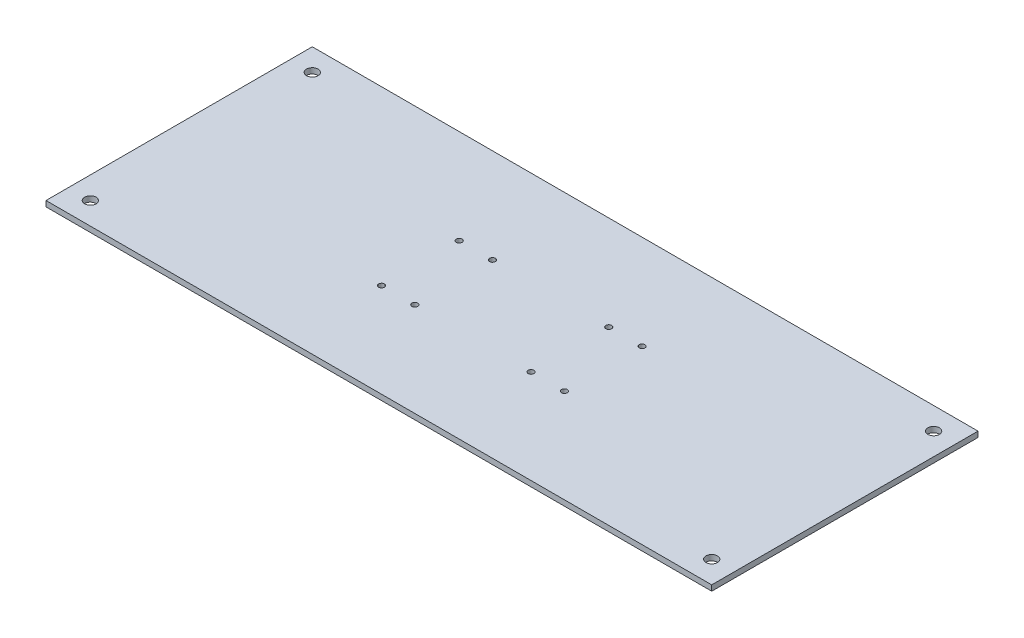
ISO-10303-21;
HEADER;
FILE_DESCRIPTION(('STEP AP214'),'2;1');
FILE_NAME('part.step','',(''),(''),'','','');
FILE_SCHEMA(('AUTOMOTIVE_DESIGN { 1 0 10303 214 1 1 1 1 }'));
ENDSEC;
DATA;
#1=APPLICATION_CONTEXT('core data for automotive mechanical design processes');
#2=APPLICATION_PROTOCOL_DEFINITION('international standard','automotive_design',2000,#1);
#3=PRODUCT_CONTEXT('',#1,'mechanical');
#4=PRODUCT('Part','Part','',(#3));
#5=PRODUCT_RELATED_PRODUCT_CATEGORY('part','',(#4));
#6=PRODUCT_DEFINITION_FORMATION('','',#4);
#7=PRODUCT_DEFINITION_CONTEXT('part definition',#1,'design');
#8=PRODUCT_DEFINITION('design','',#6,#7);
#9=PRODUCT_DEFINITION_SHAPE('','',#8);
#10=(LENGTH_UNIT() NAMED_UNIT(*) SI_UNIT(.MILLI.,.METRE.));
#11=(NAMED_UNIT(*) PLANE_ANGLE_UNIT() SI_UNIT($,.RADIAN.));
#12=(NAMED_UNIT(*) SI_UNIT($,.STERADIAN.) SOLID_ANGLE_UNIT());
#13=UNCERTAINTY_MEASURE_WITH_UNIT(LENGTH_MEASURE(1.E-05),#10,'distance_accuracy_value','');
#14=(GEOMETRIC_REPRESENTATION_CONTEXT(3) GLOBAL_UNCERTAINTY_ASSIGNED_CONTEXT((#13)) GLOBAL_UNIT_ASSIGNED_CONTEXT((#10,
#11,#12)) REPRESENTATION_CONTEXT('',''));
#15=CARTESIAN_POINT('',(0.,0.,0.));
#16=DIRECTION('',(0.,0.,1.));
#17=DIRECTION('',(1.,0.,0.));
#18=AXIS2_PLACEMENT_3D('',#15,#16,#17);
#19=CARTESIAN_POINT('',(0.,3.175,0.));
#20=DIRECTION('',(0.,1.,0.));
#21=DIRECTION('',(0.,0.,1.));
#22=AXIS2_PLACEMENT_3D('',#19,#20,#21);
#23=PLANE('',#22);
#24=CARTESIAN_POINT('',(52.324,3.175,22.352));
#25=DIRECTION('',(0.,1.,0.));
#26=DIRECTION('',(0.,0.,-1.));
#27=AXIS2_PLACEMENT_3D('',#24,#25,#26);
#28=CIRCLE('',#27,1.651);
#29=CARTESIAN_POINT('',(52.324,3.175,20.701));
#30=VERTEX_POINT('',#29);
#31=EDGE_CURVE('E169',#30,#30,#28,.T.);
#32=ORIENTED_EDGE('',*,*,#31,.F.);
#33=EDGE_LOOP('',(#32));
#34=FACE_BOUND('',#33,.T.);
#35=CARTESIAN_POINT('',(33.274,3.175,-22.098));
#36=DIRECTION('',(0.,1.,0.));
#37=DIRECTION('',(0.,0.,-1.));
#38=AXIS2_PLACEMENT_3D('',#35,#36,#37);
#39=CIRCLE('',#38,1.651);
#40=CARTESIAN_POINT('',(33.274,3.175,-23.749));
#41=VERTEX_POINT('',#40);
#42=EDGE_CURVE('E157',#41,#41,#39,.T.);
#43=ORIENTED_EDGE('',*,*,#42,.F.);
#44=EDGE_LOOP('',(#43));
#45=FACE_BOUND('',#44,.T.);
#46=CARTESIAN_POINT('',(-33.274,3.175,-22.098));
#47=DIRECTION('',(0.,1.,0.));
#48=DIRECTION('',(0.,0.,1.));
#49=AXIS2_PLACEMENT_3D('',#46,#47,#48);
#50=CIRCLE('',#49,1.651);
#51=CARTESIAN_POINT('',(-33.274,3.175,-20.447));
#52=VERTEX_POINT('',#51);
#53=EDGE_CURVE('E145',#52,#52,#50,.T.);
#54=ORIENTED_EDGE('',*,*,#53,.F.);
#55=EDGE_LOOP('',(#54));
#56=FACE_BOUND('',#55,.T.);
#57=CARTESIAN_POINT('',(-52.324,3.175,-22.098));
#58=DIRECTION('',(0.,1.,0.));
#59=DIRECTION('',(0.,0.,1.));
#60=AXIS2_PLACEMENT_3D('',#57,#58,#59);
#61=CIRCLE('',#60,1.651);
#62=CARTESIAN_POINT('',(-52.324,3.175,-20.447));
#63=VERTEX_POINT('',#62);
#64=EDGE_CURVE('E133',#63,#63,#61,.T.);
#65=ORIENTED_EDGE('',*,*,#64,.F.);
#66=EDGE_LOOP('',(#65));
#67=FACE_BOUND('',#66,.T.);
#68=CARTESIAN_POINT('',(-177.8,3.175,63.5));
#69=DIRECTION('',(0.,1.,0.));
#70=DIRECTION('',(0.,0.,-1.));
#71=AXIS2_PLACEMENT_3D('',#68,#69,#70);
#72=CIRCLE('',#71,3.30200000000001);
#73=CARTESIAN_POINT('',(-177.8,3.175,60.1979999999999));
#74=VERTEX_POINT('',#73);
#75=EDGE_CURVE('E121',#74,#74,#72,.T.);
#76=ORIENTED_EDGE('',*,*,#75,.F.);
#77=EDGE_LOOP('',(#76));
#78=FACE_BOUND('',#77,.T.);
#79=CARTESIAN_POINT('',(-177.8,3.175,-63.5));
#80=DIRECTION('',(0.,1.,0.));
#81=DIRECTION('',(0.,0.,1.));
#82=AXIS2_PLACEMENT_3D('',#79,#80,#81);
#83=CIRCLE('',#82,3.30200000000001);
#84=CARTESIAN_POINT('',(-177.8,3.175,-60.198));
#85=VERTEX_POINT('',#84);
#86=EDGE_CURVE('E100',#85,#85,#83,.T.);
#87=ORIENTED_EDGE('',*,*,#86,.F.);
#88=EDGE_LOOP('',(#87));
#89=FACE_BOUND('',#88,.T.);
#90=DIRECTION('',(0.,0.,1.));
#91=VECTOR('',#90,1.);
#92=CARTESIAN_POINT('',(-190.5,3.175,-76.2));
#93=LINE('',#92,#91);
#94=CARTESIAN_POINT('',(-190.5,3.175,-76.2));
#95=VERTEX_POINT('',#94);
#96=CARTESIAN_POINT('',(-190.5,3.175,76.2));
#97=VERTEX_POINT('',#96);
#98=EDGE_CURVE('E85',#95,#97,#93,.T.);
#99=ORIENTED_EDGE('',*,*,#98,.T.);
#100=DIRECTION('',(1.,0.,0.));
#101=VECTOR('',#100,1.);
#102=CARTESIAN_POINT('',(-190.5,3.175,76.2));
#103=LINE('',#102,#101);
#104=CARTESIAN_POINT('',(190.5,3.175,76.2));
#105=VERTEX_POINT('',#104);
#106=EDGE_CURVE('E80',#97,#105,#103,.T.);
#107=ORIENTED_EDGE('',*,*,#106,.T.);
#108=DIRECTION('',(0.,0.,-1.));
#109=VECTOR('',#108,1.);
#110=CARTESIAN_POINT('',(190.5,3.175,-76.2));
#111=LINE('',#110,#109);
#112=CARTESIAN_POINT('',(190.5,3.175,-76.2));
#113=VERTEX_POINT('',#112);
#114=EDGE_CURVE('E83',#105,#113,#111,.T.);
#115=ORIENTED_EDGE('',*,*,#114,.T.);
#116=DIRECTION('',(-1.,0.,0.));
#117=VECTOR('',#116,1.);
#118=CARTESIAN_POINT('',(-190.5,3.175,-76.2));
#119=LINE('',#118,#117);
#120=EDGE_CURVE('E50',#113,#95,#119,.T.);
#121=ORIENTED_EDGE('',*,*,#120,.T.);
#122=EDGE_LOOP('',(#99,#107,#115,#121));
#123=FACE_BOUND('',#122,.T.);
#124=CARTESIAN_POINT('',(177.8,3.175,-63.5));
#125=DIRECTION('',(0.,1.,0.));
#126=DIRECTION('',(0.,0.,-1.));
#127=AXIS2_PLACEMENT_3D('',#124,#125,#126);
#128=CIRCLE('',#127,3.30200000000001);
#129=CARTESIAN_POINT('',(177.8,3.175,-66.802));
#130=VERTEX_POINT('',#129);
#131=EDGE_CURVE('E115',#130,#130,#128,.T.);
#132=ORIENTED_EDGE('',*,*,#131,.F.);
#133=EDGE_LOOP('',(#132));
#134=FACE_BOUND('',#133,.T.);
#135=CARTESIAN_POINT('',(177.8,3.175,63.5));
#136=DIRECTION('',(0.,1.,0.));
#137=DIRECTION('',(0.,0.,1.));
#138=AXIS2_PLACEMENT_3D('',#135,#136,#137);
#139=CIRCLE('',#138,3.30200000000001);
#140=CARTESIAN_POINT('',(177.8,3.175,66.802));
#141=VERTEX_POINT('',#140);
#142=EDGE_CURVE('E127',#141,#141,#139,.T.);
#143=ORIENTED_EDGE('',*,*,#142,.F.);
#144=EDGE_LOOP('',(#143));
#145=FACE_BOUND('',#144,.T.);
#146=CARTESIAN_POINT('',(-52.324,3.175,22.352));
#147=DIRECTION('',(0.,1.,0.));
#148=DIRECTION('',(0.,0.,1.));
#149=AXIS2_PLACEMENT_3D('',#146,#147,#148);
#150=CIRCLE('',#149,1.651);
#151=CARTESIAN_POINT('',(-52.324,3.175,24.003));
#152=VERTEX_POINT('',#151);
#153=EDGE_CURVE('E139',#152,#152,#150,.T.);
#154=ORIENTED_EDGE('',*,*,#153,.F.);
#155=EDGE_LOOP('',(#154));
#156=FACE_BOUND('',#155,.T.);
#157=CARTESIAN_POINT('',(-33.274,3.175,22.352));
#158=DIRECTION('',(0.,1.,0.));
#159=DIRECTION('',(0.,0.,1.));
#160=AXIS2_PLACEMENT_3D('',#157,#158,#159);
#161=CIRCLE('',#160,1.651);
#162=CARTESIAN_POINT('',(-33.274,3.175,24.003));
#163=VERTEX_POINT('',#162);
#164=EDGE_CURVE('E151',#163,#163,#161,.T.);
#165=ORIENTED_EDGE('',*,*,#164,.F.);
#166=EDGE_LOOP('',(#165));
#167=FACE_BOUND('',#166,.T.);
#168=CARTESIAN_POINT('',(33.274,3.175,22.352));
#169=DIRECTION('',(0.,1.,0.));
#170=DIRECTION('',(0.,0.,-1.));
#171=AXIS2_PLACEMENT_3D('',#168,#169,#170);
#172=CIRCLE('',#171,1.651);
#173=CARTESIAN_POINT('',(33.274,3.175,20.701));
#174=VERTEX_POINT('',#173);
#175=EDGE_CURVE('E163',#174,#174,#172,.T.);
#176=ORIENTED_EDGE('',*,*,#175,.F.);
#177=EDGE_LOOP('',(#176));
#178=FACE_BOUND('',#177,.T.);
#179=CARTESIAN_POINT('',(52.324,3.175,-22.098));
#180=DIRECTION('',(0.,1.,0.));
#181=DIRECTION('',(0.,0.,-1.));
#182=AXIS2_PLACEMENT_3D('',#179,#180,#181);
#183=CIRCLE('',#182,1.651);
#184=CARTESIAN_POINT('',(52.324,3.175,-23.749));
#185=VERTEX_POINT('',#184);
#186=EDGE_CURVE('E175',#185,#185,#183,.T.);
#187=ORIENTED_EDGE('',*,*,#186,.F.);
#188=EDGE_LOOP('',(#187));
#189=FACE_BOUND('',#188,.T.);
#190=ADVANCED_FACE('F33',(#34,#45,#56,#67,#78,#89,#123,#134,#145,#156,#167,#178,#189),#23,.T.);
#191=CARTESIAN_POINT('',(0.,0.,0.));
#192=DIRECTION('',(0.,1.,0.));
#193=DIRECTION('',(0.,0.,1.));
#194=AXIS2_PLACEMENT_3D('',#191,#192,#193);
#195=PLANE('',#194);
#196=CARTESIAN_POINT('',(52.324,0.,22.352));
#197=DIRECTION('',(0.,1.,0.));
#198=DIRECTION('',(0.,0.,-1.));
#199=AXIS2_PLACEMENT_3D('',#196,#197,#198);
#200=CIRCLE('',#199,1.651);
#201=CARTESIAN_POINT('',(52.324,0.,20.701));
#202=VERTEX_POINT('',#201);
#203=EDGE_CURVE('E172',#202,#202,#200,.T.);
#204=ORIENTED_EDGE('',*,*,#203,.T.);
#205=EDGE_LOOP('',(#204));
#206=FACE_BOUND('',#205,.T.);
#207=CARTESIAN_POINT('',(33.274,0.,-22.098));
#208=DIRECTION('',(0.,1.,0.));
#209=DIRECTION('',(0.,0.,-1.));
#210=AXIS2_PLACEMENT_3D('',#207,#208,#209);
#211=CIRCLE('',#210,1.651);
#212=CARTESIAN_POINT('',(33.274,0.,-23.749));
#213=VERTEX_POINT('',#212);
#214=EDGE_CURVE('E160',#213,#213,#211,.T.);
#215=ORIENTED_EDGE('',*,*,#214,.T.);
#216=EDGE_LOOP('',(#215));
#217=FACE_BOUND('',#216,.T.);
#218=CARTESIAN_POINT('',(-33.274,0.,-22.098));
#219=DIRECTION('',(0.,1.,0.));
#220=DIRECTION('',(0.,0.,1.));
#221=AXIS2_PLACEMENT_3D('',#218,#219,#220);
#222=CIRCLE('',#221,1.651);
#223=CARTESIAN_POINT('',(-33.274,0.,-20.447));
#224=VERTEX_POINT('',#223);
#225=EDGE_CURVE('E148',#224,#224,#222,.T.);
#226=ORIENTED_EDGE('',*,*,#225,.T.);
#227=EDGE_LOOP('',(#226));
#228=FACE_BOUND('',#227,.T.);
#229=CARTESIAN_POINT('',(-52.324,0.,-22.098));
#230=DIRECTION('',(0.,1.,0.));
#231=DIRECTION('',(0.,0.,1.));
#232=AXIS2_PLACEMENT_3D('',#229,#230,#231);
#233=CIRCLE('',#232,1.651);
#234=CARTESIAN_POINT('',(-52.324,0.,-20.447));
#235=VERTEX_POINT('',#234);
#236=EDGE_CURVE('E136',#235,#235,#233,.T.);
#237=ORIENTED_EDGE('',*,*,#236,.T.);
#238=EDGE_LOOP('',(#237));
#239=FACE_BOUND('',#238,.T.);
#240=CARTESIAN_POINT('',(-177.8,0.,63.5));
#241=DIRECTION('',(0.,1.,0.));
#242=DIRECTION('',(0.,0.,-1.));
#243=AXIS2_PLACEMENT_3D('',#240,#241,#242);
#244=CIRCLE('',#243,3.30200000000001);
#245=CARTESIAN_POINT('',(-177.8,0.,60.1979999999999));
#246=VERTEX_POINT('',#245);
#247=EDGE_CURVE('E124',#246,#246,#244,.T.);
#248=ORIENTED_EDGE('',*,*,#247,.T.);
#249=EDGE_LOOP('',(#248));
#250=FACE_BOUND('',#249,.T.);
#251=CARTESIAN_POINT('',(-177.8,0.,-63.5));
#252=DIRECTION('',(0.,1.,0.));
#253=DIRECTION('',(0.,0.,1.));
#254=AXIS2_PLACEMENT_3D('',#251,#252,#253);
#255=CIRCLE('',#254,3.30200000000001);
#256=CARTESIAN_POINT('',(-177.8,0.,-60.198));
#257=VERTEX_POINT('',#256);
#258=EDGE_CURVE('E112',#257,#257,#255,.T.);
#259=ORIENTED_EDGE('',*,*,#258,.T.);
#260=EDGE_LOOP('',(#259));
#261=FACE_BOUND('',#260,.T.);
#262=DIRECTION('',(0.,0.,1.));
#263=VECTOR('',#262,1.);
#264=CARTESIAN_POINT('',(-190.5,0.,-76.2));
#265=LINE('',#264,#263);
#266=CARTESIAN_POINT('',(-190.5,0.,-76.2));
#267=VERTEX_POINT('',#266);
#268=CARTESIAN_POINT('',(-190.5,0.,76.2));
#269=VERTEX_POINT('',#268);
#270=EDGE_CURVE('E97',#267,#269,#265,.T.);
#271=ORIENTED_EDGE('',*,*,#270,.F.);
#272=DIRECTION('',(-1.,0.,0.));
#273=VECTOR('',#272,1.);
#274=CARTESIAN_POINT('',(-190.5,0.,-76.2));
#275=LINE('',#274,#273);
#276=CARTESIAN_POINT('',(190.5,0.,-76.2));
#277=VERTEX_POINT('',#276);
#278=EDGE_CURVE('E73',#277,#267,#275,.T.);
#279=ORIENTED_EDGE('',*,*,#278,.F.);
#280=DIRECTION('',(0.,0.,-1.));
#281=VECTOR('',#280,1.);
#282=CARTESIAN_POINT('',(190.5,0.,-76.2));
#283=LINE('',#282,#281);
#284=CARTESIAN_POINT('',(190.5,0.,76.2));
#285=VERTEX_POINT('',#284);
#286=EDGE_CURVE('E67',#285,#277,#283,.T.);
#287=ORIENTED_EDGE('',*,*,#286,.F.);
#288=DIRECTION('',(1.,0.,0.));
#289=VECTOR('',#288,1.);
#290=CARTESIAN_POINT('',(-190.5,0.,76.2));
#291=LINE('',#290,#289);
#292=EDGE_CURVE('E89',#269,#285,#291,.T.);
#293=ORIENTED_EDGE('',*,*,#292,.F.);
#294=EDGE_LOOP('',(#271,#279,#287,#293));
#295=FACE_BOUND('',#294,.T.);
#296=CARTESIAN_POINT('',(177.8,0.,-63.5));
#297=DIRECTION('',(0.,1.,0.));
#298=DIRECTION('',(0.,0.,-1.));
#299=AXIS2_PLACEMENT_3D('',#296,#297,#298);
#300=CIRCLE('',#299,3.30200000000001);
#301=CARTESIAN_POINT('',(177.8,0.,-66.802));
#302=VERTEX_POINT('',#301);
#303=EDGE_CURVE('E118',#302,#302,#300,.T.);
#304=ORIENTED_EDGE('',*,*,#303,.T.);
#305=EDGE_LOOP('',(#304));
#306=FACE_BOUND('',#305,.T.);
#307=CARTESIAN_POINT('',(177.8,0.,63.5));
#308=DIRECTION('',(0.,1.,0.));
#309=DIRECTION('',(0.,0.,1.));
#310=AXIS2_PLACEMENT_3D('',#307,#308,#309);
#311=CIRCLE('',#310,3.30200000000001);
#312=CARTESIAN_POINT('',(177.8,0.,66.802));
#313=VERTEX_POINT('',#312);
#314=EDGE_CURVE('E130',#313,#313,#311,.T.);
#315=ORIENTED_EDGE('',*,*,#314,.T.);
#316=EDGE_LOOP('',(#315));
#317=FACE_BOUND('',#316,.T.);
#318=CARTESIAN_POINT('',(-52.324,0.,22.352));
#319=DIRECTION('',(0.,1.,0.));
#320=DIRECTION('',(0.,0.,1.));
#321=AXIS2_PLACEMENT_3D('',#318,#319,#320);
#322=CIRCLE('',#321,1.651);
#323=CARTESIAN_POINT('',(-52.324,0.,24.003));
#324=VERTEX_POINT('',#323);
#325=EDGE_CURVE('E142',#324,#324,#322,.T.);
#326=ORIENTED_EDGE('',*,*,#325,.T.);
#327=EDGE_LOOP('',(#326));
#328=FACE_BOUND('',#327,.T.);
#329=CARTESIAN_POINT('',(-33.274,0.,22.352));
#330=DIRECTION('',(0.,1.,0.));
#331=DIRECTION('',(0.,0.,1.));
#332=AXIS2_PLACEMENT_3D('',#329,#330,#331);
#333=CIRCLE('',#332,1.651);
#334=CARTESIAN_POINT('',(-33.274,0.,24.003));
#335=VERTEX_POINT('',#334);
#336=EDGE_CURVE('E154',#335,#335,#333,.T.);
#337=ORIENTED_EDGE('',*,*,#336,.T.);
#338=EDGE_LOOP('',(#337));
#339=FACE_BOUND('',#338,.T.);
#340=CARTESIAN_POINT('',(33.274,0.,22.352));
#341=DIRECTION('',(0.,1.,0.));
#342=DIRECTION('',(0.,0.,-1.));
#343=AXIS2_PLACEMENT_3D('',#340,#341,#342);
#344=CIRCLE('',#343,1.651);
#345=CARTESIAN_POINT('',(33.274,0.,20.701));
#346=VERTEX_POINT('',#345);
#347=EDGE_CURVE('E166',#346,#346,#344,.T.);
#348=ORIENTED_EDGE('',*,*,#347,.T.);
#349=EDGE_LOOP('',(#348));
#350=FACE_BOUND('',#349,.T.);
#351=CARTESIAN_POINT('',(52.324,0.,-22.098));
#352=DIRECTION('',(0.,1.,0.));
#353=DIRECTION('',(0.,0.,-1.));
#354=AXIS2_PLACEMENT_3D('',#351,#352,#353);
#355=CIRCLE('',#354,1.651);
#356=CARTESIAN_POINT('',(52.324,0.,-23.749));
#357=VERTEX_POINT('',#356);
#358=EDGE_CURVE('E178',#357,#357,#355,.T.);
#359=ORIENTED_EDGE('',*,*,#358,.T.);
#360=EDGE_LOOP('',(#359));
#361=FACE_BOUND('',#360,.T.);
#362=ADVANCED_FACE('F108',(#206,#217,#228,#239,#250,#261,#295,#306,#317,#328,#339,#350,#361),
#195,.F.);
#363=CARTESIAN_POINT('',(-190.5,3.175,-76.2));
#364=DIRECTION('',(1.,0.,0.));
#365=DIRECTION('',(0.,0.,-1.));
#366=AXIS2_PLACEMENT_3D('',#363,#364,#365);
#367=PLANE('',#366);
#368=ORIENTED_EDGE('',*,*,#270,.T.);
#369=DIRECTION('',(0.,-1.,0.));
#370=VECTOR('',#369,1.);
#371=CARTESIAN_POINT('',(-190.5,3.175,76.2));
#372=LINE('',#371,#370);
#373=EDGE_CURVE('E11',#97,#269,#372,.T.);
#374=ORIENTED_EDGE('',*,*,#373,.F.);
#375=ORIENTED_EDGE('',*,*,#98,.F.);
#376=DIRECTION('',(0.,-1.,0.));
#377=VECTOR('',#376,1.);
#378=CARTESIAN_POINT('',(-190.5,3.175,-76.2));
#379=LINE('',#378,#377);
#380=EDGE_CURVE('E93',#95,#267,#379,.T.);
#381=ORIENTED_EDGE('',*,*,#380,.T.);
#382=EDGE_LOOP('',(#368,#374,#375,#381));
#383=FACE_BOUND('',#382,.T.);
#384=ADVANCED_FACE('F35',(#383),#367,.F.);
#385=CARTESIAN_POINT('',(-190.5,3.175,76.2));
#386=DIRECTION('',(0.,0.,-1.));
#387=DIRECTION('',(-1.,0.,0.));
#388=AXIS2_PLACEMENT_3D('',#385,#386,#387);
#389=PLANE('',#388);
#390=ORIENTED_EDGE('',*,*,#292,.T.);
#391=DIRECTION('',(0.,-1.,0.));
#392=VECTOR('',#391,1.);
#393=CARTESIAN_POINT('',(190.5,3.175,76.2));
#394=LINE('',#393,#392);
#395=EDGE_CURVE('E42',#105,#285,#394,.T.);
#396=ORIENTED_EDGE('',*,*,#395,.F.);
#397=ORIENTED_EDGE('',*,*,#106,.F.);
#398=ORIENTED_EDGE('',*,*,#373,.T.);
#399=EDGE_LOOP('',(#390,#396,#397,#398));
#400=FACE_BOUND('',#399,.T.);
#401=ADVANCED_FACE('F88',(#400),#389,.F.);
#402=CARTESIAN_POINT('',(190.5,3.175,-76.2));
#403=DIRECTION('',(-1.,0.,0.));
#404=DIRECTION('',(0.,0.,1.));
#405=AXIS2_PLACEMENT_3D('',#402,#403,#404);
#406=PLANE('',#405);
#407=ORIENTED_EDGE('',*,*,#286,.T.);
#408=DIRECTION('',(0.,-1.,0.));
#409=VECTOR('',#408,1.);
#410=CARTESIAN_POINT('',(190.5,3.175,-76.2));
#411=LINE('',#410,#409);
#412=EDGE_CURVE('E90',#113,#277,#411,.T.);
#413=ORIENTED_EDGE('',*,*,#412,.F.);
#414=ORIENTED_EDGE('',*,*,#114,.F.);
#415=ORIENTED_EDGE('',*,*,#395,.T.);
#416=EDGE_LOOP('',(#407,#413,#414,#415));
#417=FACE_BOUND('',#416,.T.);
#418=ADVANCED_FACE('F91',(#417),#406,.F.);
#419=CARTESIAN_POINT('',(-190.5,3.175,-76.2));
#420=DIRECTION('',(0.,0.,1.));
#421=DIRECTION('',(1.,0.,0.));
#422=AXIS2_PLACEMENT_3D('',#419,#420,#421);
#423=PLANE('',#422);
#424=ORIENTED_EDGE('',*,*,#278,.T.);
#425=ORIENTED_EDGE('',*,*,#380,.F.);
#426=ORIENTED_EDGE('',*,*,#120,.F.);
#427=ORIENTED_EDGE('',*,*,#412,.T.);
#428=EDGE_LOOP('',(#424,#425,#426,#427));
#429=FACE_BOUND('',#428,.T.);
#430=ADVANCED_FACE('F105',(#429),#423,.F.);
#431=CARTESIAN_POINT('',(-177.8,3.175,-63.5));
#432=DIRECTION('',(0.,-1.,0.));
#433=DIRECTION('',(0.,0.,-1.));
#434=AXIS2_PLACEMENT_3D('',#431,#432,#433);
#435=CYLINDRICAL_SURFACE('',#434,3.30200000000001);
#436=ORIENTED_EDGE('',*,*,#86,.T.);
#437=EDGE_LOOP('',(#436));
#438=FACE_BOUND('',#437,.T.);
#439=ORIENTED_EDGE('',*,*,#258,.F.);
#440=EDGE_LOOP('',(#439));
#441=FACE_BOUND('',#440,.T.);
#442=ADVANCED_FACE('F198',(#438,#441),#435,.F.);
#443=CARTESIAN_POINT('',(177.8,3.175,-63.5));
#444=DIRECTION('',(0.,-1.,0.));
#445=DIRECTION('',(0.,0.,-1.));
#446=AXIS2_PLACEMENT_3D('',#443,#444,#445);
#447=CYLINDRICAL_SURFACE('',#446,3.30200000000001);
#448=ORIENTED_EDGE('',*,*,#131,.T.);
#449=EDGE_LOOP('',(#448));
#450=FACE_BOUND('',#449,.T.);
#451=ORIENTED_EDGE('',*,*,#303,.F.);
#452=EDGE_LOOP('',(#451));
#453=FACE_BOUND('',#452,.T.);
#454=ADVANCED_FACE('F244',(#450,#453),#447,.F.);
#455=CARTESIAN_POINT('',(-177.8,3.175,63.5));
#456=DIRECTION('',(0.,-1.,0.));
#457=DIRECTION('',(0.,0.,-1.));
#458=AXIS2_PLACEMENT_3D('',#455,#456,#457);
#459=CYLINDRICAL_SURFACE('',#458,3.30200000000001);
#460=ORIENTED_EDGE('',*,*,#75,.T.);
#461=EDGE_LOOP('',(#460));
#462=FACE_BOUND('',#461,.T.);
#463=ORIENTED_EDGE('',*,*,#247,.F.);
#464=EDGE_LOOP('',(#463));
#465=FACE_BOUND('',#464,.T.);
#466=ADVANCED_FACE('F252',(#462,#465),#459,.F.);
#467=CARTESIAN_POINT('',(177.8,3.175,63.5));
#468=DIRECTION('',(0.,-1.,0.));
#469=DIRECTION('',(0.,0.,-1.));
#470=AXIS2_PLACEMENT_3D('',#467,#468,#469);
#471=CYLINDRICAL_SURFACE('',#470,3.30200000000001);
#472=ORIENTED_EDGE('',*,*,#142,.T.);
#473=EDGE_LOOP('',(#472));
#474=FACE_BOUND('',#473,.T.);
#475=ORIENTED_EDGE('',*,*,#314,.F.);
#476=EDGE_LOOP('',(#475));
#477=FACE_BOUND('',#476,.T.);
#478=ADVANCED_FACE('F260',(#474,#477),#471,.F.);
#479=CARTESIAN_POINT('',(-52.324,3.175,-22.098));
#480=DIRECTION('',(0.,-1.,0.));
#481=DIRECTION('',(0.,0.,-1.));
#482=AXIS2_PLACEMENT_3D('',#479,#480,#481);
#483=CYLINDRICAL_SURFACE('',#482,1.651);
#484=ORIENTED_EDGE('',*,*,#64,.T.);
#485=EDGE_LOOP('',(#484));
#486=FACE_BOUND('',#485,.T.);
#487=ORIENTED_EDGE('',*,*,#236,.F.);
#488=EDGE_LOOP('',(#487));
#489=FACE_BOUND('',#488,.T.);
#490=ADVANCED_FACE('F269',(#486,#489),#483,.F.);
#491=CARTESIAN_POINT('',(-52.324,3.175,22.352));
#492=DIRECTION('',(0.,-1.,0.));
#493=DIRECTION('',(0.,0.,-1.));
#494=AXIS2_PLACEMENT_3D('',#491,#492,#493);
#495=CYLINDRICAL_SURFACE('',#494,1.651);
#496=ORIENTED_EDGE('',*,*,#153,.T.);
#497=EDGE_LOOP('',(#496));
#498=FACE_BOUND('',#497,.T.);
#499=ORIENTED_EDGE('',*,*,#325,.F.);
#500=EDGE_LOOP('',(#499));
#501=FACE_BOUND('',#500,.T.);
#502=ADVANCED_FACE('F278',(#498,#501),#495,.F.);
#503=CARTESIAN_POINT('',(-33.274,3.175,-22.098));
#504=DIRECTION('',(0.,-1.,0.));
#505=DIRECTION('',(0.,0.,-1.));
#506=AXIS2_PLACEMENT_3D('',#503,#504,#505);
#507=CYLINDRICAL_SURFACE('',#506,1.651);
#508=ORIENTED_EDGE('',*,*,#53,.T.);
#509=EDGE_LOOP('',(#508));
#510=FACE_BOUND('',#509,.T.);
#511=ORIENTED_EDGE('',*,*,#225,.F.);
#512=EDGE_LOOP('',(#511));
#513=FACE_BOUND('',#512,.T.);
#514=ADVANCED_FACE('F287',(#510,#513),#507,.F.);
#515=CARTESIAN_POINT('',(-33.274,3.175,22.352));
#516=DIRECTION('',(0.,-1.,0.));
#517=DIRECTION('',(0.,0.,-1.));
#518=AXIS2_PLACEMENT_3D('',#515,#516,#517);
#519=CYLINDRICAL_SURFACE('',#518,1.651);
#520=ORIENTED_EDGE('',*,*,#164,.T.);
#521=EDGE_LOOP('',(#520));
#522=FACE_BOUND('',#521,.T.);
#523=ORIENTED_EDGE('',*,*,#336,.F.);
#524=EDGE_LOOP('',(#523));
#525=FACE_BOUND('',#524,.T.);
#526=ADVANCED_FACE('F296',(#522,#525),#519,.F.);
#527=CARTESIAN_POINT('',(33.274,3.175,-22.098));
#528=DIRECTION('',(0.,-1.,0.));
#529=DIRECTION('',(0.,0.,-1.));
#530=AXIS2_PLACEMENT_3D('',#527,#528,#529);
#531=CYLINDRICAL_SURFACE('',#530,1.651);
#532=ORIENTED_EDGE('',*,*,#42,.T.);
#533=EDGE_LOOP('',(#532));
#534=FACE_BOUND('',#533,.T.);
#535=ORIENTED_EDGE('',*,*,#214,.F.);
#536=EDGE_LOOP('',(#535));
#537=FACE_BOUND('',#536,.T.);
#538=ADVANCED_FACE('F305',(#534,#537),#531,.F.);
#539=CARTESIAN_POINT('',(33.274,3.175,22.352));
#540=DIRECTION('',(0.,-1.,0.));
#541=DIRECTION('',(0.,0.,-1.));
#542=AXIS2_PLACEMENT_3D('',#539,#540,#541);
#543=CYLINDRICAL_SURFACE('',#542,1.651);
#544=ORIENTED_EDGE('',*,*,#175,.T.);
#545=EDGE_LOOP('',(#544));
#546=FACE_BOUND('',#545,.T.);
#547=ORIENTED_EDGE('',*,*,#347,.F.);
#548=EDGE_LOOP('',(#547));
#549=FACE_BOUND('',#548,.T.);
#550=ADVANCED_FACE('F314',(#546,#549),#543,.F.);
#551=CARTESIAN_POINT('',(52.324,3.175,22.352));
#552=DIRECTION('',(0.,-1.,0.));
#553=DIRECTION('',(0.,0.,-1.));
#554=AXIS2_PLACEMENT_3D('',#551,#552,#553);
#555=CYLINDRICAL_SURFACE('',#554,1.651);
#556=ORIENTED_EDGE('',*,*,#31,.T.);
#557=EDGE_LOOP('',(#556));
#558=FACE_BOUND('',#557,.T.);
#559=ORIENTED_EDGE('',*,*,#203,.F.);
#560=EDGE_LOOP('',(#559));
#561=FACE_BOUND('',#560,.T.);
#562=ADVANCED_FACE('F323',(#558,#561),#555,.F.);
#563=CARTESIAN_POINT('',(52.324,3.175,-22.098));
#564=DIRECTION('',(0.,-1.,0.));
#565=DIRECTION('',(0.,0.,-1.));
#566=AXIS2_PLACEMENT_3D('',#563,#564,#565);
#567=CYLINDRICAL_SURFACE('',#566,1.651);
#568=ORIENTED_EDGE('',*,*,#186,.T.);
#569=EDGE_LOOP('',(#568));
#570=FACE_BOUND('',#569,.T.);
#571=ORIENTED_EDGE('',*,*,#358,.F.);
#572=EDGE_LOOP('',(#571));
#573=FACE_BOUND('',#572,.T.);
#574=ADVANCED_FACE('F184',(#570,#573),#567,.F.);
#575=CLOSED_SHELL('',(#190,#362,#384,#401,#418,#430,#442,#454,#466,#478,#490,#502,#514,#526,
#538,#550,#562,#574));
#576=MANIFOLD_SOLID_BREP('B2',#575);
#577=ADVANCED_BREP_SHAPE_REPRESENTATION('',(#18,#576),#14);
#578=SHAPE_DEFINITION_REPRESENTATION(#9,#577);
ENDSEC;
END-ISO-10303-21;
